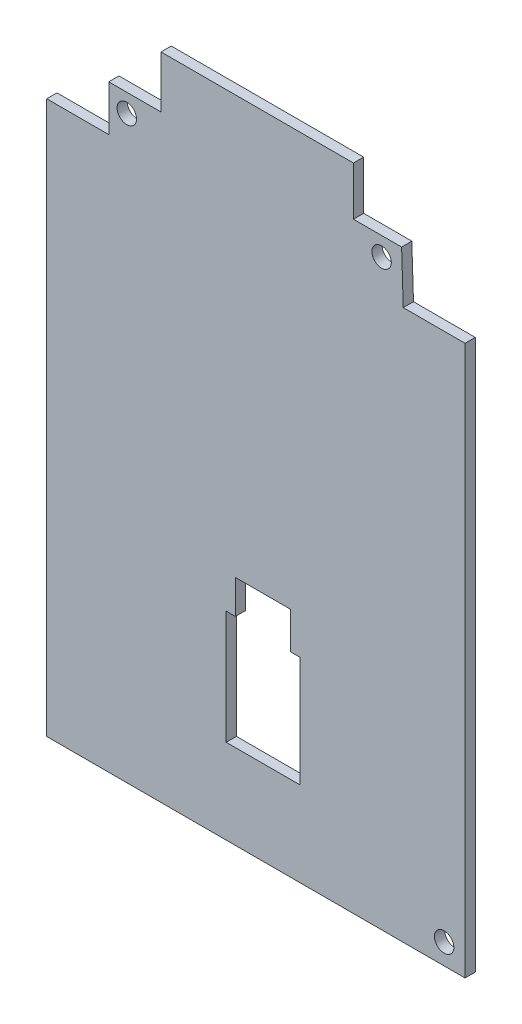
ISO-10303-21;
HEADER;
FILE_DESCRIPTION(('STEP AP214'),'2;1');
FILE_NAME('part.step','',(''),(''),'','','');
FILE_SCHEMA(('AUTOMOTIVE_DESIGN { 1 0 10303 214 1 1 1 1 }'));
ENDSEC;
DATA;
#1=APPLICATION_CONTEXT('core data for automotive mechanical design processes');
#2=APPLICATION_PROTOCOL_DEFINITION('international standard','automotive_design',2000,#1);
#3=PRODUCT_CONTEXT('',#1,'mechanical');
#4=PRODUCT('Part','Part','',(#3));
#5=PRODUCT_RELATED_PRODUCT_CATEGORY('part','',(#4));
#6=PRODUCT_DEFINITION_FORMATION('','',#4);
#7=PRODUCT_DEFINITION_CONTEXT('part definition',#1,'design');
#8=PRODUCT_DEFINITION('design','',#6,#7);
#9=PRODUCT_DEFINITION_SHAPE('','',#8);
#10=(LENGTH_UNIT() NAMED_UNIT(*) SI_UNIT(.MILLI.,.METRE.));
#11=(NAMED_UNIT(*) PLANE_ANGLE_UNIT() SI_UNIT($,.RADIAN.));
#12=(NAMED_UNIT(*) SI_UNIT($,.STERADIAN.) SOLID_ANGLE_UNIT());
#13=UNCERTAINTY_MEASURE_WITH_UNIT(LENGTH_MEASURE(1.E-05),#10,'distance_accuracy_value','');
#14=(GEOMETRIC_REPRESENTATION_CONTEXT(3) GLOBAL_UNCERTAINTY_ASSIGNED_CONTEXT((#13)) GLOBAL_UNIT_ASSIGNED_CONTEXT((#10,
#11,#12)) REPRESENTATION_CONTEXT('',''));
#15=CARTESIAN_POINT('',(0.,0.,0.));
#16=DIRECTION('',(0.,0.,1.));
#17=DIRECTION('',(1.,0.,0.));
#18=AXIS2_PLACEMENT_3D('',#15,#16,#17);
#19=CARTESIAN_POINT('',(214.972137991222,208.138369839312,4.0581));
#20=DIRECTION('',(0.,0.,1.));
#21=DIRECTION('',(1.,0.,0.));
#22=AXIS2_PLACEMENT_3D('',#19,#20,#21);
#23=PLANE('',#22);
#24=CARTESIAN_POINT('',(371.14770904771,261.391824811286,4.0581));
#25=DIRECTION('',(0.,0.,-1.));
#26=DIRECTION('',(-1.,0.,0.));
#27=AXIS2_PLACEMENT_3D('',#24,#25,#26);
#28=CIRCLE('',#27,2.00755295361729);
#29=CARTESIAN_POINT('',(369.140156094093,261.391824811286,4.0581));
#30=VERTEX_POINT('',#29);
#31=EDGE_CURVE('E217',#30,#30,#28,.T.);
#32=ORIENTED_EDGE('',*,*,#31,.T.);
#33=EDGE_LOOP('',(#32));
#34=FACE_BOUND('',#33,.T.);
#35=CARTESIAN_POINT('',(305.517175864031,376.973345940423,4.0581));
#36=DIRECTION('',(0.,0.,-1.));
#37=DIRECTION('',(-1.,0.,0.));
#38=AXIS2_PLACEMENT_3D('',#35,#36,#37);
#39=CIRCLE('',#38,2.0075586744018);
#40=CARTESIAN_POINT('',(303.509617189629,376.973345940423,4.0581));
#41=VERTEX_POINT('',#40);
#42=EDGE_CURVE('E615',#41,#41,#39,.T.);
#43=ORIENTED_EDGE('',*,*,#42,.T.);
#44=EDGE_LOOP('',(#43));
#45=FACE_BOUND('',#44,.T.);
#46=CARTESIAN_POINT('',(358.210559160375,377.608204279985,4.0581));
#47=DIRECTION('',(0.,0.,-1.));
#48=DIRECTION('',(-1.,0.,0.));
#49=AXIS2_PLACEMENT_3D('',#46,#47,#48);
#50=CIRCLE('',#49,2.00755486054547);
#51=CARTESIAN_POINT('',(356.203004299829,377.608204279985,4.0581));
#52=VERTEX_POINT('',#51);
#53=EDGE_CURVE('E622',#52,#52,#50,.T.);
#54=ORIENTED_EDGE('',*,*,#53,.T.);
#55=EDGE_LOOP('',(#54));
#56=FACE_BOUND('',#55,.T.);
#57=DIRECTION('',(1.,0.,0.));
#58=VECTOR('',#57,1.);
#59=CARTESIAN_POINT('',(288.95907131358,257.098536187395,4.0581));
#60=LINE('',#59,#58);
#61=CARTESIAN_POINT('',(288.95907131358,257.098536187395,4.0581));
#62=VERTEX_POINT('',#61);
#63=CARTESIAN_POINT('',(375.466886763463,257.098536187395,4.0581));
#64=VERTEX_POINT('',#63);
#65=EDGE_CURVE('E247',#62,#64,#60,.T.);
#66=ORIENTED_EDGE('',*,*,#65,.T.);
#67=DIRECTION('',(0.,1.,0.));
#68=VECTOR('',#67,1.);
#69=CARTESIAN_POINT('',(375.466886763463,257.098536187395,4.0581));
#70=LINE('',#69,#68);
#71=CARTESIAN_POINT('',(375.466886763463,370.782483727915,4.0581));
#72=VERTEX_POINT('',#71);
#73=EDGE_CURVE('E250',#64,#72,#70,.T.);
#74=ORIENTED_EDGE('',*,*,#73,.T.);
#75=DIRECTION('',(-1.,0.,0.));
#76=VECTOR('',#75,1.);
#77=CARTESIAN_POINT('',(375.466886763463,370.782483727915,4.0581));
#78=LINE('',#77,#76);
#79=CARTESIAN_POINT('',(362.689517317706,370.782483727915,4.0581));
#80=VERTEX_POINT('',#79);
#81=EDGE_CURVE('E253',#72,#80,#78,.T.);
#82=ORIENTED_EDGE('',*,*,#81,.T.);
#83=DIRECTION('',(-0.0318252331463633,0.999493448970617,0.));
#84=VECTOR('',#83,1.);
#85=CARTESIAN_POINT('',(362.689517317706,370.782483727915,4.0581));
#86=LINE('',#85,#84);
#87=CARTESIAN_POINT('',(362.349407570675,381.463865464359,4.0581));
#88=VERTEX_POINT('',#87);
#89=EDGE_CURVE('E255',#80,#88,#86,.T.);
#90=ORIENTED_EDGE('',*,*,#89,.T.);
#91=DIRECTION('',(-1.,0.,0.));
#92=VECTOR('',#91,1.);
#93=CARTESIAN_POINT('',(362.349407570675,381.463865464359,4.0581));
#94=LINE('',#93,#92);
#95=CARTESIAN_POINT('',(352.392226270696,381.463865464359,4.0581));
#96=VERTEX_POINT('',#95);
#97=EDGE_CURVE('E257',#88,#96,#94,.T.);
#98=ORIENTED_EDGE('',*,*,#97,.T.);
#99=DIRECTION('',(0.,1.,0.));
#100=VECTOR('',#99,1.);
#101=CARTESIAN_POINT('',(352.392226270696,381.463865464359,4.0581));
#102=LINE('',#101,#100);
#103=CARTESIAN_POINT('',(352.392226270696,391.530418414058,4.0581));
#104=VERTEX_POINT('',#103);
#105=EDGE_CURVE('E259',#96,#104,#102,.T.);
#106=ORIENTED_EDGE('',*,*,#105,.T.);
#107=DIRECTION('',(-1.,0.,0.));
#108=VECTOR('',#107,1.);
#109=CARTESIAN_POINT('',(352.392226270696,391.530418414058,4.0581));
#110=LINE('',#109,#108);
#111=CARTESIAN_POINT('',(312.592018051443,391.530418414058,4.0581));
#112=VERTEX_POINT('',#111);
#113=EDGE_CURVE('E261',#104,#112,#110,.T.);
#114=ORIENTED_EDGE('',*,*,#113,.T.);
#115=DIRECTION('',(0.,-1.,0.));
#116=VECTOR('',#115,1.);
#117=CARTESIAN_POINT('',(312.592018051443,391.530418414058,4.0581));
#118=LINE('',#117,#116);
#119=CARTESIAN_POINT('',(312.592018051443,380.768550178379,4.0581));
#120=VERTEX_POINT('',#119);
#121=EDGE_CURVE('E263',#112,#120,#118,.T.);
#122=ORIENTED_EDGE('',*,*,#121,.T.);
#123=DIRECTION('',(-1.,0.,0.));
#124=VECTOR('',#123,1.);
#125=CARTESIAN_POINT('',(312.592018051443,380.768550178379,4.0581));
#126=LINE('',#125,#124);
#127=CARTESIAN_POINT('',(301.785345082154,380.768550178379,4.0581));
#128=VERTEX_POINT('',#127);
#129=EDGE_CURVE('E265',#120,#128,#126,.T.);
#130=ORIENTED_EDGE('',*,*,#129,.T.);
#131=DIRECTION('',(0.,-1.,0.));
#132=VECTOR('',#131,1.);
#133=CARTESIAN_POINT('',(301.785345082154,380.768550178379,4.0581));
#134=LINE('',#133,#132);
#135=CARTESIAN_POINT('',(301.785345082154,371.32036551502,4.0581));
#136=VERTEX_POINT('',#135);
#137=EDGE_CURVE('E267',#128,#136,#134,.T.);
#138=ORIENTED_EDGE('',*,*,#137,.T.);
#139=DIRECTION('',(-1.,0.,0.));
#140=VECTOR('',#139,1.);
#141=CARTESIAN_POINT('',(301.785345082154,371.32036551502,4.0581));
#142=LINE('',#141,#140);
#143=CARTESIAN_POINT('',(288.95907131358,371.32036551502,4.0581));
#144=VERTEX_POINT('',#143);
#145=EDGE_CURVE('E269',#136,#144,#142,.T.);
#146=ORIENTED_EDGE('',*,*,#145,.T.);
#147=DIRECTION('',(0.,-1.,0.));
#148=VECTOR('',#147,1.);
#149=CARTESIAN_POINT('',(288.95907131358,371.32036551502,4.0581));
#150=LINE('',#149,#148);
#151=EDGE_CURVE('E271',#144,#62,#150,.T.);
#152=ORIENTED_EDGE('',*,*,#151,.T.);
#153=EDGE_LOOP('',(#66,#74,#82,#90,#98,#106,#114,#122,#130,#138,#146,#152));
#154=FACE_BOUND('',#153,.T.);
#155=DIRECTION('',(-1.,0.,0.));
#156=VECTOR('',#155,1.);
#157=CARTESIAN_POINT('',(339.40470053705,305.094194349548,4.0581));
#158=LINE('',#157,#156);
#159=CARTESIAN_POINT('',(339.40470053705,305.094194349548,4.0581));
#160=VERTEX_POINT('',#159);
#161=CARTESIAN_POINT('',(327.977219914081,305.094194349548,4.0581));
#162=VERTEX_POINT('',#161);
#163=EDGE_CURVE('E188',#160,#162,#158,.T.);
#164=ORIENTED_EDGE('',*,*,#163,.F.);
#165=DIRECTION('',(0.,1.,0.));
#166=VECTOR('',#165,1.);
#167=CARTESIAN_POINT('',(339.40470053705,297.475871391664,4.0581));
#168=LINE('',#167,#166);
#169=CARTESIAN_POINT('',(339.40470053705,297.475871391664,4.0581));
#170=VERTEX_POINT('',#169);
#171=EDGE_CURVE('E180',#170,#160,#168,.T.);
#172=ORIENTED_EDGE('',*,*,#171,.F.);
#173=DIRECTION('',(-1.,0.,0.));
#174=VECTOR('',#173,1.);
#175=CARTESIAN_POINT('',(341.309279369593,297.475871391664,4.0581));
#176=LINE('',#175,#174);
#177=CARTESIAN_POINT('',(341.309279369593,297.475871391664,4.0581));
#178=VERTEX_POINT('',#177);
#179=EDGE_CURVE('E214',#178,#170,#176,.T.);
#180=ORIENTED_EDGE('',*,*,#179,.F.);
#181=DIRECTION('',(0.,1.,0.));
#182=VECTOR('',#181,1.);
#183=CARTESIAN_POINT('',(341.309279369593,274.620917773437,4.0581));
#184=LINE('',#183,#182);
#185=CARTESIAN_POINT('',(341.309279369593,274.620917773437,4.0581));
#186=VERTEX_POINT('',#185);
#187=EDGE_CURVE('E212',#186,#178,#184,.T.);
#188=ORIENTED_EDGE('',*,*,#187,.F.);
#189=DIRECTION('',(1.,0.,0.));
#190=VECTOR('',#189,1.);
#191=CARTESIAN_POINT('',(326.072641081538,274.620917773437,4.0581));
#192=LINE('',#191,#190);
#193=CARTESIAN_POINT('',(326.072641081538,274.620917773437,4.0581));
#194=VERTEX_POINT('',#193);
#195=EDGE_CURVE('E210',#194,#186,#192,.T.);
#196=ORIENTED_EDGE('',*,*,#195,.F.);
#197=DIRECTION('',(0.,-1.,0.));
#198=VECTOR('',#197,1.);
#199=CARTESIAN_POINT('',(326.072641081538,298.110733545082,4.0581));
#200=LINE('',#199,#198);
#201=CARTESIAN_POINT('',(326.072641081538,298.110733545082,4.0581));
#202=VERTEX_POINT('',#201);
#203=EDGE_CURVE('E208',#202,#194,#200,.T.);
#204=ORIENTED_EDGE('',*,*,#203,.F.);
#205=DIRECTION('',(-1.,0.,0.));
#206=VECTOR('',#205,1.);
#207=CARTESIAN_POINT('',(327.977219914081,298.110733545082,4.0581));
#208=LINE('',#207,#206);
#209=CARTESIAN_POINT('',(327.977219914081,298.110733545082,4.0581));
#210=VERTEX_POINT('',#209);
#211=EDGE_CURVE('E203',#210,#202,#208,.T.);
#212=ORIENTED_EDGE('',*,*,#211,.F.);
#213=DIRECTION('',(0.,-1.,0.));
#214=VECTOR('',#213,1.);
#215=CARTESIAN_POINT('',(327.977219914081,305.094194349548,4.0581));
#216=LINE('',#215,#214);
#217=EDGE_CURVE('E201',#162,#210,#216,.T.);
#218=ORIENTED_EDGE('',*,*,#217,.F.);
#219=EDGE_LOOP('',(#164,#172,#180,#188,#196,#204,#212,#218));
#220=FACE_BOUND('',#219,.T.);
#221=ADVANCED_FACE('F43',(#34,#45,#56,#154,#220),#23,.T.);
#222=CARTESIAN_POINT('',(214.972137991222,208.138369839312,1.9419));
#223=DIRECTION('',(0.,0.,1.));
#224=DIRECTION('',(1.,0.,0.));
#225=AXIS2_PLACEMENT_3D('',#222,#223,#224);
#226=PLANE('',#225);
#227=CARTESIAN_POINT('',(371.14770904771,261.391824811286,1.9419));
#228=DIRECTION('',(0.,0.,-1.));
#229=DIRECTION('',(-1.,0.,0.));
#230=AXIS2_PLACEMENT_3D('',#227,#228,#229);
#231=CIRCLE('',#230,2.00755295361729);
#232=CARTESIAN_POINT('',(369.140156094093,261.391824811286,1.9419));
#233=VERTEX_POINT('',#232);
#234=EDGE_CURVE('E610',#233,#233,#231,.T.);
#235=ORIENTED_EDGE('',*,*,#234,.F.);
#236=EDGE_LOOP('',(#235));
#237=FACE_BOUND('',#236,.T.);
#238=CARTESIAN_POINT('',(305.517175864031,376.973345940423,1.9419));
#239=DIRECTION('',(0.,0.,-1.));
#240=DIRECTION('',(-1.,0.,0.));
#241=AXIS2_PLACEMENT_3D('',#238,#239,#240);
#242=CIRCLE('',#241,2.0075586744018);
#243=CARTESIAN_POINT('',(303.509617189629,376.973345940423,1.9419));
#244=VERTEX_POINT('',#243);
#245=EDGE_CURVE('E611',#244,#244,#242,.T.);
#246=ORIENTED_EDGE('',*,*,#245,.F.);
#247=EDGE_LOOP('',(#246));
#248=FACE_BOUND('',#247,.T.);
#249=CARTESIAN_POINT('',(358.210559160375,377.608204279985,1.9419));
#250=DIRECTION('',(0.,0.,-1.));
#251=DIRECTION('',(-1.,0.,0.));
#252=AXIS2_PLACEMENT_3D('',#249,#250,#251);
#253=CIRCLE('',#252,2.00755486054547);
#254=CARTESIAN_POINT('',(356.203004299829,377.608204279985,1.9419));
#255=VERTEX_POINT('',#254);
#256=EDGE_CURVE('E620',#255,#255,#253,.T.);
#257=ORIENTED_EDGE('',*,*,#256,.F.);
#258=EDGE_LOOP('',(#257));
#259=FACE_BOUND('',#258,.T.);
#260=DIRECTION('',(1.,0.,0.));
#261=VECTOR('',#260,1.);
#262=CARTESIAN_POINT('',(288.95907131358,257.098536187395,1.9419));
#263=LINE('',#262,#261);
#264=CARTESIAN_POINT('',(288.95907131358,257.098536187395,1.9419));
#265=VERTEX_POINT('',#264);
#266=CARTESIAN_POINT('',(375.466886763463,257.098536187395,1.9419));
#267=VERTEX_POINT('',#266);
#268=EDGE_CURVE('E196',#265,#267,#263,.T.);
#269=ORIENTED_EDGE('',*,*,#268,.F.);
#270=DIRECTION('',(0.,-1.,0.));
#271=VECTOR('',#270,1.);
#272=CARTESIAN_POINT('',(288.95907131358,371.32036551502,1.9419));
#273=LINE('',#272,#271);
#274=CARTESIAN_POINT('',(288.95907131358,371.32036551502,1.9419));
#275=VERTEX_POINT('',#274);
#276=EDGE_CURVE('E251',#275,#265,#273,.T.);
#277=ORIENTED_EDGE('',*,*,#276,.F.);
#278=DIRECTION('',(-1.,0.,0.));
#279=VECTOR('',#278,1.);
#280=CARTESIAN_POINT('',(301.785345082154,371.32036551502,1.9419));
#281=LINE('',#280,#279);
#282=CARTESIAN_POINT('',(301.785345082154,371.32036551502,1.9419));
#283=VERTEX_POINT('',#282);
#284=EDGE_CURVE('E294',#283,#275,#281,.T.);
#285=ORIENTED_EDGE('',*,*,#284,.F.);
#286=DIRECTION('',(0.,-1.,0.));
#287=VECTOR('',#286,1.);
#288=CARTESIAN_POINT('',(301.785345082154,380.768550178379,1.9419));
#289=LINE('',#288,#287);
#290=CARTESIAN_POINT('',(301.785345082154,380.768550178379,1.9419));
#291=VERTEX_POINT('',#290);
#292=EDGE_CURVE('E292',#291,#283,#289,.T.);
#293=ORIENTED_EDGE('',*,*,#292,.F.);
#294=DIRECTION('',(-1.,0.,0.));
#295=VECTOR('',#294,1.);
#296=CARTESIAN_POINT('',(312.592018051443,380.768550178379,1.9419));
#297=LINE('',#296,#295);
#298=CARTESIAN_POINT('',(312.592018051443,380.768550178379,1.9419));
#299=VERTEX_POINT('',#298);
#300=EDGE_CURVE('E290',#299,#291,#297,.T.);
#301=ORIENTED_EDGE('',*,*,#300,.F.);
#302=DIRECTION('',(0.,-1.,0.));
#303=VECTOR('',#302,1.);
#304=CARTESIAN_POINT('',(312.592018051443,391.530418414058,1.9419));
#305=LINE('',#304,#303);
#306=CARTESIAN_POINT('',(312.592018051443,391.530418414058,1.9419));
#307=VERTEX_POINT('',#306);
#308=EDGE_CURVE('E288',#307,#299,#305,.T.);
#309=ORIENTED_EDGE('',*,*,#308,.F.);
#310=DIRECTION('',(-1.,0.,0.));
#311=VECTOR('',#310,1.);
#312=CARTESIAN_POINT('',(352.392226270696,391.530418414058,1.9419));
#313=LINE('',#312,#311);
#314=CARTESIAN_POINT('',(352.392226270696,391.530418414058,1.9419));
#315=VERTEX_POINT('',#314);
#316=EDGE_CURVE('E286',#315,#307,#313,.T.);
#317=ORIENTED_EDGE('',*,*,#316,.F.);
#318=DIRECTION('',(0.,1.,0.));
#319=VECTOR('',#318,1.);
#320=CARTESIAN_POINT('',(352.392226270696,381.463865464359,1.9419));
#321=LINE('',#320,#319);
#322=CARTESIAN_POINT('',(352.392226270696,381.463865464359,1.9419));
#323=VERTEX_POINT('',#322);
#324=EDGE_CURVE('E284',#323,#315,#321,.T.);
#325=ORIENTED_EDGE('',*,*,#324,.F.);
#326=DIRECTION('',(-1.,0.,0.));
#327=VECTOR('',#326,1.);
#328=CARTESIAN_POINT('',(362.349407570675,381.463865464359,1.9419));
#329=LINE('',#328,#327);
#330=CARTESIAN_POINT('',(362.349407570675,381.463865464359,1.9419));
#331=VERTEX_POINT('',#330);
#332=EDGE_CURVE('E282',#331,#323,#329,.T.);
#333=ORIENTED_EDGE('',*,*,#332,.F.);
#334=DIRECTION('',(-0.0318252331463633,0.999493448970617,0.));
#335=VECTOR('',#334,1.);
#336=CARTESIAN_POINT('',(362.689517317706,370.782483727915,1.9419));
#337=LINE('',#336,#335);
#338=CARTESIAN_POINT('',(362.689517317706,370.782483727915,1.9419));
#339=VERTEX_POINT('',#338);
#340=EDGE_CURVE('E280',#339,#331,#337,.T.);
#341=ORIENTED_EDGE('',*,*,#340,.F.);
#342=DIRECTION('',(-1.,0.,0.));
#343=VECTOR('',#342,1.);
#344=CARTESIAN_POINT('',(375.466886763463,370.782483727915,1.9419));
#345=LINE('',#344,#343);
#346=CARTESIAN_POINT('',(375.466886763463,370.782483727915,1.9419));
#347=VERTEX_POINT('',#346);
#348=EDGE_CURVE('E278',#347,#339,#345,.T.);
#349=ORIENTED_EDGE('',*,*,#348,.F.);
#350=DIRECTION('',(0.,1.,0.));
#351=VECTOR('',#350,1.);
#352=CARTESIAN_POINT('',(375.466886763463,257.098536187395,1.9419));
#353=LINE('',#352,#351);
#354=EDGE_CURVE('E276',#267,#347,#353,.T.);
#355=ORIENTED_EDGE('',*,*,#354,.F.);
#356=EDGE_LOOP('',(#269,#277,#285,#293,#301,#309,#317,#325,#333,#341,#349,#355));
#357=FACE_BOUND('',#356,.T.);
#358=DIRECTION('',(0.,1.,0.));
#359=VECTOR('',#358,1.);
#360=CARTESIAN_POINT('',(339.40470053705,297.475871391664,1.9419));
#361=LINE('',#360,#359);
#362=CARTESIAN_POINT('',(339.40470053705,297.475871391664,1.9419));
#363=VERTEX_POINT('',#362);
#364=CARTESIAN_POINT('',(339.40470053705,305.094194349548,1.9419));
#365=VERTEX_POINT('',#364);
#366=EDGE_CURVE('E66',#363,#365,#361,.T.);
#367=ORIENTED_EDGE('',*,*,#366,.T.);
#368=DIRECTION('',(-1.,0.,0.));
#369=VECTOR('',#368,1.);
#370=CARTESIAN_POINT('',(339.40470053705,305.094194349548,1.9419));
#371=LINE('',#370,#369);
#372=CARTESIAN_POINT('',(327.977219914081,305.094194349548,1.9419));
#373=VERTEX_POINT('',#372);
#374=EDGE_CURVE('E195',#365,#373,#371,.T.);
#375=ORIENTED_EDGE('',*,*,#374,.T.);
#376=DIRECTION('',(0.,-1.,0.));
#377=VECTOR('',#376,1.);
#378=CARTESIAN_POINT('',(327.977219914081,305.094194349548,1.9419));
#379=LINE('',#378,#377);
#380=CARTESIAN_POINT('',(327.977219914081,298.110733545082,1.9419));
#381=VERTEX_POINT('',#380);
#382=EDGE_CURVE('E219',#373,#381,#379,.T.);
#383=ORIENTED_EDGE('',*,*,#382,.T.);
#384=DIRECTION('',(-1.,0.,0.));
#385=VECTOR('',#384,1.);
#386=CARTESIAN_POINT('',(327.977219914081,298.110733545082,1.9419));
#387=LINE('',#386,#385);
#388=CARTESIAN_POINT('',(326.072641081538,298.110733545082,1.9419));
#389=VERTEX_POINT('',#388);
#390=EDGE_CURVE('E222',#381,#389,#387,.T.);
#391=ORIENTED_EDGE('',*,*,#390,.T.);
#392=DIRECTION('',(0.,-1.,0.));
#393=VECTOR('',#392,1.);
#394=CARTESIAN_POINT('',(326.072641081538,298.110733545082,1.9419));
#395=LINE('',#394,#393);
#396=CARTESIAN_POINT('',(326.072641081538,274.620917773437,1.9419));
#397=VERTEX_POINT('',#396);
#398=EDGE_CURVE('E225',#389,#397,#395,.T.);
#399=ORIENTED_EDGE('',*,*,#398,.T.);
#400=DIRECTION('',(1.,0.,0.));
#401=VECTOR('',#400,1.);
#402=CARTESIAN_POINT('',(326.072641081538,274.620917773437,1.9419));
#403=LINE('',#402,#401);
#404=CARTESIAN_POINT('',(341.309279369593,274.620917773437,1.9419));
#405=VERTEX_POINT('',#404);
#406=EDGE_CURVE('E228',#397,#405,#403,.T.);
#407=ORIENTED_EDGE('',*,*,#406,.T.);
#408=DIRECTION('',(0.,1.,0.));
#409=VECTOR('',#408,1.);
#410=CARTESIAN_POINT('',(341.309279369593,274.620917773437,1.9419));
#411=LINE('',#410,#409);
#412=CARTESIAN_POINT('',(341.309279369593,297.475871391664,1.9419));
#413=VERTEX_POINT('',#412);
#414=EDGE_CURVE('E231',#405,#413,#411,.T.);
#415=ORIENTED_EDGE('',*,*,#414,.T.);
#416=DIRECTION('',(-1.,0.,0.));
#417=VECTOR('',#416,1.);
#418=CARTESIAN_POINT('',(341.309279369593,297.475871391664,1.9419));
#419=LINE('',#418,#417);
#420=EDGE_CURVE('E189',#413,#363,#419,.T.);
#421=ORIENTED_EDGE('',*,*,#420,.T.);
#422=EDGE_LOOP('',(#367,#375,#383,#391,#399,#407,#415,#421));
#423=FACE_BOUND('',#422,.T.);
#424=ADVANCED_FACE('F336',(#237,#248,#259,#357,#423),#226,.F.);
#425=CARTESIAN_POINT('',(288.95907131358,257.098536187395,4.0581));
#426=DIRECTION('',(0.,1.,0.));
#427=DIRECTION('',(0.,0.,1.));
#428=AXIS2_PLACEMENT_3D('',#425,#426,#427);
#429=PLANE('',#428);
#430=ORIENTED_EDGE('',*,*,#268,.T.);
#431=DIRECTION('',(0.,0.,-1.));
#432=VECTOR('',#431,1.);
#433=CARTESIAN_POINT('',(375.466886763463,257.098536187395,4.0581));
#434=LINE('',#433,#432);
#435=EDGE_CURVE('E11',#64,#267,#434,.T.);
#436=ORIENTED_EDGE('',*,*,#435,.F.);
#437=ORIENTED_EDGE('',*,*,#65,.F.);
#438=DIRECTION('',(0.,0.,-1.));
#439=VECTOR('',#438,1.);
#440=CARTESIAN_POINT('',(288.95907131358,257.098536187395,4.0581));
#441=LINE('',#440,#439);
#442=EDGE_CURVE('E273',#62,#265,#441,.T.);
#443=ORIENTED_EDGE('',*,*,#442,.T.);
#444=EDGE_LOOP('',(#430,#436,#437,#443));
#445=FACE_BOUND('',#444,.T.);
#446=ADVANCED_FACE('F45',(#445),#429,.F.);
#447=CARTESIAN_POINT('',(375.466886763463,257.098536187395,4.0581));
#448=DIRECTION('',(-1.,0.,0.));
#449=DIRECTION('',(0.,0.,1.));
#450=AXIS2_PLACEMENT_3D('',#447,#448,#449);
#451=PLANE('',#450);
#452=ORIENTED_EDGE('',*,*,#354,.T.);
#453=DIRECTION('',(0.,0.,-1.));
#454=VECTOR('',#453,1.);
#455=CARTESIAN_POINT('',(375.466886763463,370.782483727915,4.0581));
#456=LINE('',#455,#454);
#457=EDGE_CURVE('E51',#72,#347,#456,.T.);
#458=ORIENTED_EDGE('',*,*,#457,.F.);
#459=ORIENTED_EDGE('',*,*,#73,.F.);
#460=ORIENTED_EDGE('',*,*,#435,.T.);
#461=EDGE_LOOP('',(#452,#458,#459,#460));
#462=FACE_BOUND('',#461,.T.);
#463=ADVANCED_FACE('F353',(#462),#451,.F.);
#464=CARTESIAN_POINT('',(375.466886763463,370.782483727915,4.0581));
#465=DIRECTION('',(0.,-1.,0.));
#466=DIRECTION('',(0.,0.,-1.));
#467=AXIS2_PLACEMENT_3D('',#464,#465,#466);
#468=PLANE('',#467);
#469=ORIENTED_EDGE('',*,*,#348,.T.);
#470=DIRECTION('',(0.,0.,-1.));
#471=VECTOR('',#470,1.);
#472=CARTESIAN_POINT('',(362.689517317706,370.782483727915,4.0581));
#473=LINE('',#472,#471);
#474=EDGE_CURVE('E323',#80,#339,#473,.T.);
#475=ORIENTED_EDGE('',*,*,#474,.F.);
#476=ORIENTED_EDGE('',*,*,#81,.F.);
#477=ORIENTED_EDGE('',*,*,#457,.T.);
#478=EDGE_LOOP('',(#469,#475,#476,#477));
#479=FACE_BOUND('',#478,.T.);
#480=ADVANCED_FACE('F330',(#479),#468,.F.);
#481=CARTESIAN_POINT('',(362.689517317706,370.782483727915,4.0581));
#482=DIRECTION('',(-0.999493448970617,-0.0318252331463633,0.));
#483=DIRECTION('',(0.0318252331463633,-0.999493448970617,0.));
#484=AXIS2_PLACEMENT_3D('',#481,#482,#483);
#485=PLANE('',#484);
#486=ORIENTED_EDGE('',*,*,#340,.T.);
#487=DIRECTION('',(0.,0.,-1.));
#488=VECTOR('',#487,1.);
#489=CARTESIAN_POINT('',(362.349407570675,381.463865464359,4.0581));
#490=LINE('',#489,#488);
#491=EDGE_CURVE('E320',#88,#331,#490,.T.);
#492=ORIENTED_EDGE('',*,*,#491,.F.);
#493=ORIENTED_EDGE('',*,*,#89,.F.);
#494=ORIENTED_EDGE('',*,*,#474,.T.);
#495=EDGE_LOOP('',(#486,#492,#493,#494));
#496=FACE_BOUND('',#495,.T.);
#497=ADVANCED_FACE('F342',(#496),#485,.F.);
#498=CARTESIAN_POINT('',(362.349407570675,381.463865464359,4.0581));
#499=DIRECTION('',(0.,-1.,0.));
#500=DIRECTION('',(0.,0.,-1.));
#501=AXIS2_PLACEMENT_3D('',#498,#499,#500);
#502=PLANE('',#501);
#503=ORIENTED_EDGE('',*,*,#332,.T.);
#504=DIRECTION('',(0.,0.,-1.));
#505=VECTOR('',#504,1.);
#506=CARTESIAN_POINT('',(352.392226270696,381.463865464359,4.0581));
#507=LINE('',#506,#505);
#508=EDGE_CURVE('E317',#96,#323,#507,.T.);
#509=ORIENTED_EDGE('',*,*,#508,.F.);
#510=ORIENTED_EDGE('',*,*,#97,.F.);
#511=ORIENTED_EDGE('',*,*,#491,.T.);
#512=EDGE_LOOP('',(#503,#509,#510,#511));
#513=FACE_BOUND('',#512,.T.);
#514=ADVANCED_FACE('F346',(#513),#502,.F.);
#515=CARTESIAN_POINT('',(352.392226270696,381.463865464359,4.0581));
#516=DIRECTION('',(-1.,0.,0.));
#517=DIRECTION('',(0.,0.,1.));
#518=AXIS2_PLACEMENT_3D('',#515,#516,#517);
#519=PLANE('',#518);
#520=ORIENTED_EDGE('',*,*,#324,.T.);
#521=DIRECTION('',(0.,0.,-1.));
#522=VECTOR('',#521,1.);
#523=CARTESIAN_POINT('',(352.392226270696,391.530418414058,4.0581));
#524=LINE('',#523,#522);
#525=EDGE_CURVE('E314',#104,#315,#524,.T.);
#526=ORIENTED_EDGE('',*,*,#525,.F.);
#527=ORIENTED_EDGE('',*,*,#105,.F.);
#528=ORIENTED_EDGE('',*,*,#508,.T.);
#529=EDGE_LOOP('',(#520,#526,#527,#528));
#530=FACE_BOUND('',#529,.T.);
#531=ADVANCED_FACE('F386',(#530),#519,.F.);
#532=CARTESIAN_POINT('',(352.392226270696,391.530418414058,4.0581));
#533=DIRECTION('',(0.,-1.,0.));
#534=DIRECTION('',(0.,0.,-1.));
#535=AXIS2_PLACEMENT_3D('',#532,#533,#534);
#536=PLANE('',#535);
#537=ORIENTED_EDGE('',*,*,#316,.T.);
#538=DIRECTION('',(0.,0.,-1.));
#539=VECTOR('',#538,1.);
#540=CARTESIAN_POINT('',(312.592018051443,391.530418414058,4.0581));
#541=LINE('',#540,#539);
#542=EDGE_CURVE('E311',#112,#307,#541,.T.);
#543=ORIENTED_EDGE('',*,*,#542,.F.);
#544=ORIENTED_EDGE('',*,*,#113,.F.);
#545=ORIENTED_EDGE('',*,*,#525,.T.);
#546=EDGE_LOOP('',(#537,#543,#544,#545));
#547=FACE_BOUND('',#546,.T.);
#548=ADVANCED_FACE('F384',(#547),#536,.F.);
#549=CARTESIAN_POINT('',(312.592018051443,391.530418414058,4.0581));
#550=DIRECTION('',(1.,0.,0.));
#551=DIRECTION('',(0.,0.,-1.));
#552=AXIS2_PLACEMENT_3D('',#549,#550,#551);
#553=PLANE('',#552);
#554=ORIENTED_EDGE('',*,*,#308,.T.);
#555=DIRECTION('',(0.,0.,-1.));
#556=VECTOR('',#555,1.);
#557=CARTESIAN_POINT('',(312.592018051443,380.768550178379,4.0581));
#558=LINE('',#557,#556);
#559=EDGE_CURVE('E308',#120,#299,#558,.T.);
#560=ORIENTED_EDGE('',*,*,#559,.F.);
#561=ORIENTED_EDGE('',*,*,#121,.F.);
#562=ORIENTED_EDGE('',*,*,#542,.T.);
#563=EDGE_LOOP('',(#554,#560,#561,#562));
#564=FACE_BOUND('',#563,.T.);
#565=ADVANCED_FACE('F380',(#564),#553,.F.);
#566=CARTESIAN_POINT('',(312.592018051443,380.768550178379,4.0581));
#567=DIRECTION('',(0.,-1.,0.));
#568=DIRECTION('',(0.,0.,-1.));
#569=AXIS2_PLACEMENT_3D('',#566,#567,#568);
#570=PLANE('',#569);
#571=ORIENTED_EDGE('',*,*,#300,.T.);
#572=DIRECTION('',(0.,0.,-1.));
#573=VECTOR('',#572,1.);
#574=CARTESIAN_POINT('',(301.785345082154,380.768550178379,4.0581));
#575=LINE('',#574,#573);
#576=EDGE_CURVE('E305',#128,#291,#575,.T.);
#577=ORIENTED_EDGE('',*,*,#576,.F.);
#578=ORIENTED_EDGE('',*,*,#129,.F.);
#579=ORIENTED_EDGE('',*,*,#559,.T.);
#580=EDGE_LOOP('',(#571,#577,#578,#579));
#581=FACE_BOUND('',#580,.T.);
#582=ADVANCED_FACE('F375',(#581),#570,.F.);
#583=CARTESIAN_POINT('',(301.785345082154,380.768550178379,4.0581));
#584=DIRECTION('',(1.,0.,0.));
#585=DIRECTION('',(0.,0.,-1.));
#586=AXIS2_PLACEMENT_3D('',#583,#584,#585);
#587=PLANE('',#586);
#588=ORIENTED_EDGE('',*,*,#292,.T.);
#589=DIRECTION('',(0.,0.,-1.));
#590=VECTOR('',#589,1.);
#591=CARTESIAN_POINT('',(301.785345082154,371.32036551502,4.0581));
#592=LINE('',#591,#590);
#593=EDGE_CURVE('E302',#136,#283,#592,.T.);
#594=ORIENTED_EDGE('',*,*,#593,.F.);
#595=ORIENTED_EDGE('',*,*,#137,.F.);
#596=ORIENTED_EDGE('',*,*,#576,.T.);
#597=EDGE_LOOP('',(#588,#594,#595,#596));
#598=FACE_BOUND('',#597,.T.);
#599=ADVANCED_FACE('F369',(#598),#587,.F.);
#600=CARTESIAN_POINT('',(301.785345082154,371.32036551502,4.0581));
#601=DIRECTION('',(0.,-1.,0.));
#602=DIRECTION('',(0.,0.,-1.));
#603=AXIS2_PLACEMENT_3D('',#600,#601,#602);
#604=PLANE('',#603);
#605=ORIENTED_EDGE('',*,*,#284,.T.);
#606=DIRECTION('',(0.,0.,-1.));
#607=VECTOR('',#606,1.);
#608=CARTESIAN_POINT('',(288.95907131358,371.32036551502,4.0581));
#609=LINE('',#608,#607);
#610=EDGE_CURVE('E299',#144,#275,#609,.T.);
#611=ORIENTED_EDGE('',*,*,#610,.F.);
#612=ORIENTED_EDGE('',*,*,#145,.F.);
#613=ORIENTED_EDGE('',*,*,#593,.T.);
#614=EDGE_LOOP('',(#605,#611,#612,#613));
#615=FACE_BOUND('',#614,.T.);
#616=ADVANCED_FACE('F365',(#615),#604,.F.);
#617=CARTESIAN_POINT('',(288.95907131358,371.32036551502,4.0581));
#618=DIRECTION('',(1.,0.,0.));
#619=DIRECTION('',(0.,0.,-1.));
#620=AXIS2_PLACEMENT_3D('',#617,#618,#619);
#621=PLANE('',#620);
#622=ORIENTED_EDGE('',*,*,#276,.T.);
#623=ORIENTED_EDGE('',*,*,#442,.F.);
#624=ORIENTED_EDGE('',*,*,#151,.F.);
#625=ORIENTED_EDGE('',*,*,#610,.T.);
#626=EDGE_LOOP('',(#622,#623,#624,#625));
#627=FACE_BOUND('',#626,.T.);
#628=ADVANCED_FACE('F360',(#627),#621,.F.);
#629=CARTESIAN_POINT('',(339.40470053705,297.475871391664,4.0581));
#630=DIRECTION('',(-1.,0.,0.));
#631=DIRECTION('',(0.,0.,1.));
#632=AXIS2_PLACEMENT_3D('',#629,#630,#631);
#633=PLANE('',#632);
#634=ORIENTED_EDGE('',*,*,#366,.F.);
#635=DIRECTION('',(0.,0.,-1.));
#636=VECTOR('',#635,1.);
#637=CARTESIAN_POINT('',(339.40470053705,297.475871391664,4.0581));
#638=LINE('',#637,#636);
#639=EDGE_CURVE('E184',#170,#363,#638,.T.);
#640=ORIENTED_EDGE('',*,*,#639,.F.);
#641=ORIENTED_EDGE('',*,*,#171,.T.);
#642=DIRECTION('',(0.,0.,-1.));
#643=VECTOR('',#642,1.);
#644=CARTESIAN_POINT('',(339.40470053705,305.094194349548,4.0581));
#645=LINE('',#644,#643);
#646=EDGE_CURVE('E183',#160,#365,#645,.T.);
#647=ORIENTED_EDGE('',*,*,#646,.T.);
#648=EDGE_LOOP('',(#634,#640,#641,#647));
#649=FACE_BOUND('',#648,.T.);
#650=ADVANCED_FACE('F182',(#649),#633,.T.);
#651=CARTESIAN_POINT('',(339.40470053705,305.094194349548,4.0581));
#652=DIRECTION('',(0.,-1.,0.));
#653=DIRECTION('',(0.,0.,-1.));
#654=AXIS2_PLACEMENT_3D('',#651,#652,#653);
#655=PLANE('',#654);
#656=ORIENTED_EDGE('',*,*,#374,.F.);
#657=ORIENTED_EDGE('',*,*,#646,.F.);
#658=ORIENTED_EDGE('',*,*,#163,.T.);
#659=DIRECTION('',(0.,0.,-1.));
#660=VECTOR('',#659,1.);
#661=CARTESIAN_POINT('',(327.977219914081,305.094194349548,4.0581));
#662=LINE('',#661,#660);
#663=EDGE_CURVE('E197',#162,#373,#662,.T.);
#664=ORIENTED_EDGE('',*,*,#663,.T.);
#665=EDGE_LOOP('',(#656,#657,#658,#664));
#666=FACE_BOUND('',#665,.T.);
#667=ADVANCED_FACE('F192',(#666),#655,.T.);
#668=CARTESIAN_POINT('',(327.977219914081,305.094194349548,4.0581));
#669=DIRECTION('',(1.,0.,0.));
#670=DIRECTION('',(0.,0.,-1.));
#671=AXIS2_PLACEMENT_3D('',#668,#669,#670);
#672=PLANE('',#671);
#673=ORIENTED_EDGE('',*,*,#382,.F.);
#674=ORIENTED_EDGE('',*,*,#663,.F.);
#675=ORIENTED_EDGE('',*,*,#217,.T.);
#676=DIRECTION('',(0.,0.,-1.));
#677=VECTOR('',#676,1.);
#678=CARTESIAN_POINT('',(327.977219914081,298.110733545082,4.0581));
#679=LINE('',#678,#677);
#680=EDGE_CURVE('E244',#210,#381,#679,.T.);
#681=ORIENTED_EDGE('',*,*,#680,.T.);
#682=EDGE_LOOP('',(#673,#674,#675,#681));
#683=FACE_BOUND('',#682,.T.);
#684=ADVANCED_FACE('F454',(#683),#672,.T.);
#685=CARTESIAN_POINT('',(327.977219914081,298.110733545082,4.0581));
#686=DIRECTION('',(0.,-1.,0.));
#687=DIRECTION('',(0.,0.,-1.));
#688=AXIS2_PLACEMENT_3D('',#685,#686,#687);
#689=PLANE('',#688);
#690=ORIENTED_EDGE('',*,*,#390,.F.);
#691=ORIENTED_EDGE('',*,*,#680,.F.);
#692=ORIENTED_EDGE('',*,*,#211,.T.);
#693=DIRECTION('',(0.,0.,-1.));
#694=VECTOR('',#693,1.);
#695=CARTESIAN_POINT('',(326.072641081538,298.110733545082,4.0581));
#696=LINE('',#695,#694);
#697=EDGE_CURVE('E242',#202,#389,#696,.T.);
#698=ORIENTED_EDGE('',*,*,#697,.T.);
#699=EDGE_LOOP('',(#690,#691,#692,#698));
#700=FACE_BOUND('',#699,.T.);
#701=ADVANCED_FACE('F461',(#700),#689,.T.);
#702=CARTESIAN_POINT('',(326.072641081538,298.110733545082,4.0581));
#703=DIRECTION('',(1.,0.,0.));
#704=DIRECTION('',(0.,0.,-1.));
#705=AXIS2_PLACEMENT_3D('',#702,#703,#704);
#706=PLANE('',#705);
#707=ORIENTED_EDGE('',*,*,#398,.F.);
#708=ORIENTED_EDGE('',*,*,#697,.F.);
#709=ORIENTED_EDGE('',*,*,#203,.T.);
#710=DIRECTION('',(0.,0.,-1.));
#711=VECTOR('',#710,1.);
#712=CARTESIAN_POINT('',(326.072641081538,274.620917773437,4.0581));
#713=LINE('',#712,#711);
#714=EDGE_CURVE('E240',#194,#397,#713,.T.);
#715=ORIENTED_EDGE('',*,*,#714,.T.);
#716=EDGE_LOOP('',(#707,#708,#709,#715));
#717=FACE_BOUND('',#716,.T.);
#718=ADVANCED_FACE('F470',(#717),#706,.T.);
#719=CARTESIAN_POINT('',(326.072641081538,274.620917773437,4.0581));
#720=DIRECTION('',(0.,1.,0.));
#721=DIRECTION('',(0.,0.,1.));
#722=AXIS2_PLACEMENT_3D('',#719,#720,#721);
#723=PLANE('',#722);
#724=ORIENTED_EDGE('',*,*,#406,.F.);
#725=ORIENTED_EDGE('',*,*,#714,.F.);
#726=ORIENTED_EDGE('',*,*,#195,.T.);
#727=DIRECTION('',(0.,0.,-1.));
#728=VECTOR('',#727,1.);
#729=CARTESIAN_POINT('',(341.309279369593,274.620917773437,4.0581));
#730=LINE('',#729,#728);
#731=EDGE_CURVE('E238',#186,#405,#730,.T.);
#732=ORIENTED_EDGE('',*,*,#731,.T.);
#733=EDGE_LOOP('',(#724,#725,#726,#732));
#734=FACE_BOUND('',#733,.T.);
#735=ADVANCED_FACE('F479',(#734),#723,.T.);
#736=CARTESIAN_POINT('',(341.309279369593,274.620917773437,4.0581));
#737=DIRECTION('',(-1.,0.,0.));
#738=DIRECTION('',(0.,0.,1.));
#739=AXIS2_PLACEMENT_3D('',#736,#737,#738);
#740=PLANE('',#739);
#741=ORIENTED_EDGE('',*,*,#414,.F.);
#742=ORIENTED_EDGE('',*,*,#731,.F.);
#743=ORIENTED_EDGE('',*,*,#187,.T.);
#744=DIRECTION('',(0.,0.,-1.));
#745=VECTOR('',#744,1.);
#746=CARTESIAN_POINT('',(341.309279369593,297.475871391664,4.0581));
#747=LINE('',#746,#745);
#748=EDGE_CURVE('E58',#178,#413,#747,.T.);
#749=ORIENTED_EDGE('',*,*,#748,.T.);
#750=EDGE_LOOP('',(#741,#742,#743,#749));
#751=FACE_BOUND('',#750,.T.);
#752=ADVANCED_FACE('F488',(#751),#740,.T.);
#753=CARTESIAN_POINT('',(341.309279369593,297.475871391664,4.0581));
#754=DIRECTION('',(0.,-1.,0.));
#755=DIRECTION('',(0.,0.,-1.));
#756=AXIS2_PLACEMENT_3D('',#753,#754,#755);
#757=PLANE('',#756);
#758=ORIENTED_EDGE('',*,*,#420,.F.);
#759=ORIENTED_EDGE('',*,*,#748,.F.);
#760=ORIENTED_EDGE('',*,*,#179,.T.);
#761=ORIENTED_EDGE('',*,*,#639,.T.);
#762=EDGE_LOOP('',(#758,#759,#760,#761));
#763=FACE_BOUND('',#762,.T.);
#764=ADVANCED_FACE('F497',(#763),#757,.T.);
#765=CARTESIAN_POINT('',(358.210559160375,377.608204279985,4.0581));
#766=DIRECTION('',(0.,0.,-1.));
#767=DIRECTION('',(-1.,0.,0.));
#768=AXIS2_PLACEMENT_3D('',#765,#766,#767);
#769=CYLINDRICAL_SURFACE('',#768,2.00755486054547);
#770=ORIENTED_EDGE('',*,*,#53,.F.);
#771=EDGE_LOOP('',(#770));
#772=FACE_BOUND('',#771,.T.);
#773=ORIENTED_EDGE('',*,*,#256,.T.);
#774=EDGE_LOOP('',(#773));
#775=FACE_BOUND('',#774,.T.);
#776=ADVANCED_FACE('F506',(#772,#775),#769,.F.);
#777=CARTESIAN_POINT('',(305.517175864031,376.973345940423,4.0581));
#778=DIRECTION('',(0.,0.,-1.));
#779=DIRECTION('',(-1.,0.,0.));
#780=AXIS2_PLACEMENT_3D('',#777,#778,#779);
#781=CYLINDRICAL_SURFACE('',#780,2.0075586744018);
#782=ORIENTED_EDGE('',*,*,#42,.F.);
#783=EDGE_LOOP('',(#782));
#784=FACE_BOUND('',#783,.T.);
#785=ORIENTED_EDGE('',*,*,#245,.T.);
#786=EDGE_LOOP('',(#785));
#787=FACE_BOUND('',#786,.T.);
#788=ADVANCED_FACE('F514',(#784,#787),#781,.F.);
#789=CARTESIAN_POINT('',(371.14770904771,261.391824811286,4.0581));
#790=DIRECTION('',(0.,0.,-1.));
#791=DIRECTION('',(-1.,0.,0.));
#792=AXIS2_PLACEMENT_3D('',#789,#790,#791);
#793=CYLINDRICAL_SURFACE('',#792,2.00755295361729);
#794=ORIENTED_EDGE('',*,*,#31,.F.);
#795=EDGE_LOOP('',(#794));
#796=FACE_BOUND('',#795,.T.);
#797=ORIENTED_EDGE('',*,*,#234,.T.);
#798=EDGE_LOOP('',(#797));
#799=FACE_BOUND('',#798,.T.);
#800=ADVANCED_FACE('F523',(#796,#799),#793,.F.);
#801=CLOSED_SHELL('',(#221,#424,#446,#463,#480,#497,#514,#531,#548,#565,#582,#599,#616,#628,
#650,#667,#684,#701,#718,#735,#752,#764,#776,#788,#800));
#802=MANIFOLD_SOLID_BREP('B2',#801);
#803=ADVANCED_BREP_SHAPE_REPRESENTATION('',(#18,#802),#14);
#804=SHAPE_DEFINITION_REPRESENTATION(#9,#803);
ENDSEC;
END-ISO-10303-21;
